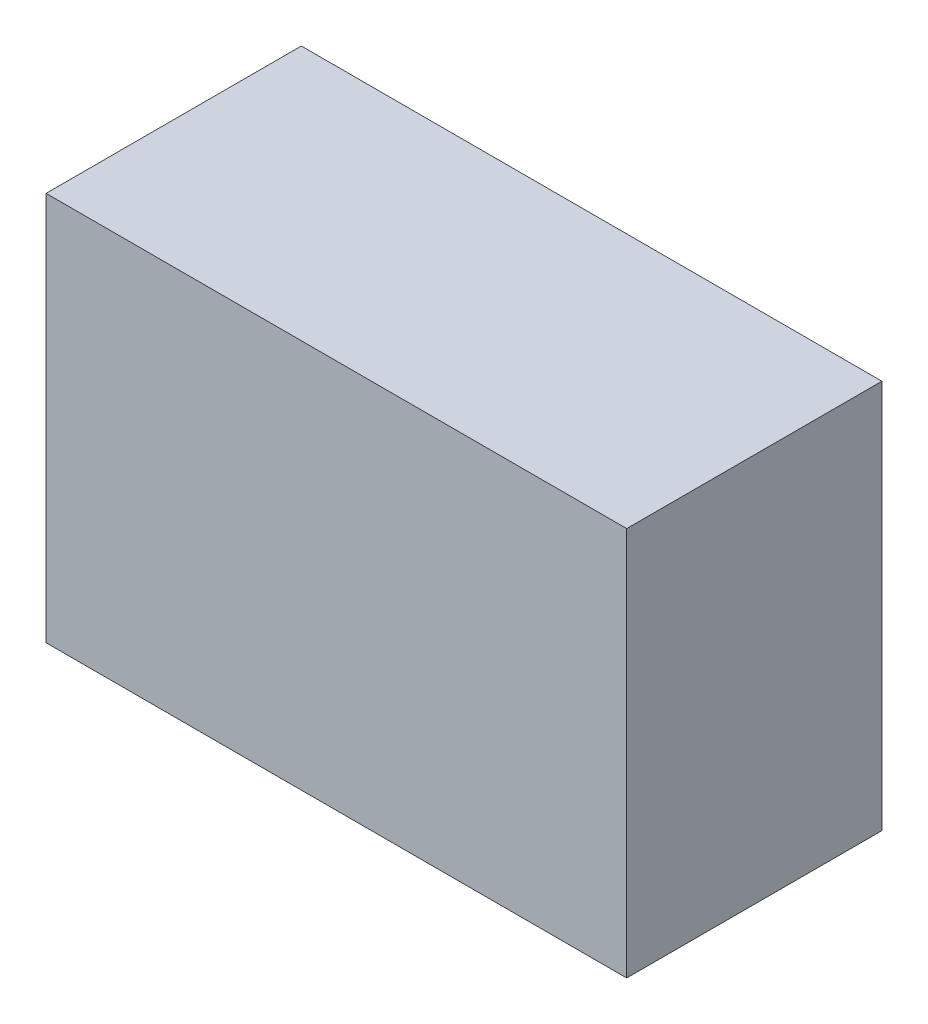
ISO-10303-21;
HEADER;
FILE_DESCRIPTION(('STEP AP214'),'2;1');
FILE_NAME('part.step','',(''),(''),'','','');
FILE_SCHEMA(('AUTOMOTIVE_DESIGN { 1 0 10303 214 1 1 1 1 }'));
ENDSEC;
DATA;
#1=APPLICATION_CONTEXT('core data for automotive mechanical design processes');
#2=APPLICATION_PROTOCOL_DEFINITION('international standard','automotive_design',2000,#1);
#3=PRODUCT_CONTEXT('',#1,'mechanical');
#4=PRODUCT('Part','Part','',(#3));
#5=PRODUCT_RELATED_PRODUCT_CATEGORY('part','',(#4));
#6=PRODUCT_DEFINITION_FORMATION('','',#4);
#7=PRODUCT_DEFINITION_CONTEXT('part definition',#1,'design');
#8=PRODUCT_DEFINITION('design','',#6,#7);
#9=PRODUCT_DEFINITION_SHAPE('','',#8);
#10=(LENGTH_UNIT() NAMED_UNIT(*) SI_UNIT(.MILLI.,.METRE.));
#11=(NAMED_UNIT(*) PLANE_ANGLE_UNIT() SI_UNIT($,.RADIAN.));
#12=(NAMED_UNIT(*) SI_UNIT($,.STERADIAN.) SOLID_ANGLE_UNIT());
#13=UNCERTAINTY_MEASURE_WITH_UNIT(LENGTH_MEASURE(1.E-05),#10,'distance_accuracy_value','');
#14=(GEOMETRIC_REPRESENTATION_CONTEXT(3) GLOBAL_UNCERTAINTY_ASSIGNED_CONTEXT((#13)) GLOBAL_UNIT_ASSIGNED_CONTEXT((#10,
#11,#12)) REPRESENTATION_CONTEXT('',''));
#15=CARTESIAN_POINT('',(0.,0.,0.));
#16=DIRECTION('',(0.,0.,1.));
#17=DIRECTION('',(1.,0.,0.));
#18=AXIS2_PLACEMENT_3D('',#15,#16,#17);
#19=CARTESIAN_POINT('',(-0.45499782,-0.30499812,0.3999992));
#20=DIRECTION('',(0.,0.,1.));
#21=DIRECTION('',(1.,0.,0.));
#22=AXIS2_PLACEMENT_3D('',#19,#20,#21);
#23=PLANE('',#22);
#24=DIRECTION('',(-1.,0.,0.));
#25=VECTOR('',#24,1.);
#26=CARTESIAN_POINT('',(0.45499782,-0.30499812,0.3999992));
#27=LINE('',#26,#25);
#28=CARTESIAN_POINT('',(0.45499782,-0.30499812,0.3999992));
#29=VERTEX_POINT('',#28);
#30=CARTESIAN_POINT('',(-0.45499782,-0.30499812,0.3999992));
#31=VERTEX_POINT('',#30);
#32=EDGE_CURVE('E21',#29,#31,#27,.T.);
#33=ORIENTED_EDGE('',*,*,#32,.F.);
#34=DIRECTION('',(0.,-1.,0.));
#35=VECTOR('',#34,1.);
#36=CARTESIAN_POINT('',(0.45499782,0.30499812,0.3999992));
#37=LINE('',#36,#35);
#38=CARTESIAN_POINT('',(0.45499782,0.30499812,0.3999992));
#39=VERTEX_POINT('',#38);
#40=EDGE_CURVE('E108',#39,#29,#37,.T.);
#41=ORIENTED_EDGE('',*,*,#40,.F.);
#42=DIRECTION('',(1.,0.,0.));
#43=VECTOR('',#42,1.);
#44=CARTESIAN_POINT('',(-0.45499782,0.30499812,0.3999992));
#45=LINE('',#44,#43);
#46=CARTESIAN_POINT('',(-0.45499782,0.30499812,0.3999992));
#47=VERTEX_POINT('',#46);
#48=EDGE_CURVE('E84',#47,#39,#45,.T.);
#49=ORIENTED_EDGE('',*,*,#48,.F.);
#50=DIRECTION('',(0.,1.,0.));
#51=VECTOR('',#50,1.);
#52=CARTESIAN_POINT('',(-0.45499782,-0.30499812,0.3999992));
#53=LINE('',#52,#51);
#54=EDGE_CURVE('E88',#31,#47,#53,.T.);
#55=ORIENTED_EDGE('',*,*,#54,.F.);
#56=EDGE_LOOP('',(#33,#41,#49,#55));
#57=FACE_BOUND('',#56,.T.);
#58=ADVANCED_FACE('F17',(#57),#23,.T.);
#59=CARTESIAN_POINT('',(-0.45499782,-0.30499812,0.));
#60=DIRECTION('',(0.,0.,1.));
#61=DIRECTION('',(1.,0.,0.));
#62=AXIS2_PLACEMENT_3D('',#59,#60,#61);
#63=PLANE('',#62);
#64=DIRECTION('',(0.,1.,0.));
#65=VECTOR('',#64,1.);
#66=CARTESIAN_POINT('',(-0.45499782,-0.30499812,0.));
#67=LINE('',#66,#65);
#68=CARTESIAN_POINT('',(-0.45499782,-0.30499812,0.));
#69=VERTEX_POINT('',#68);
#70=CARTESIAN_POINT('',(-0.45499782,0.30499812,0.));
#71=VERTEX_POINT('',#70);
#72=EDGE_CURVE('E72',#69,#71,#67,.T.);
#73=ORIENTED_EDGE('',*,*,#72,.T.);
#74=DIRECTION('',(1.,0.,0.));
#75=VECTOR('',#74,1.);
#76=CARTESIAN_POINT('',(-0.45499782,0.30499812,0.));
#77=LINE('',#76,#75);
#78=CARTESIAN_POINT('',(0.45499782,0.30499812,0.));
#79=VERTEX_POINT('',#78);
#80=EDGE_CURVE('E106',#71,#79,#77,.T.);
#81=ORIENTED_EDGE('',*,*,#80,.T.);
#82=DIRECTION('',(0.,-1.,0.));
#83=VECTOR('',#82,1.);
#84=CARTESIAN_POINT('',(0.45499782,0.30499812,0.));
#85=LINE('',#84,#83);
#86=CARTESIAN_POINT('',(0.45499782,-0.30499812,0.));
#87=VERTEX_POINT('',#86);
#88=EDGE_CURVE('E74',#79,#87,#85,.T.);
#89=ORIENTED_EDGE('',*,*,#88,.T.);
#90=DIRECTION('',(-1.,0.,0.));
#91=VECTOR('',#90,1.);
#92=CARTESIAN_POINT('',(0.45499782,-0.30499812,0.));
#93=LINE('',#92,#91);
#94=EDGE_CURVE('E11',#87,#69,#93,.T.);
#95=ORIENTED_EDGE('',*,*,#94,.T.);
#96=EDGE_LOOP('',(#73,#81,#89,#95));
#97=FACE_BOUND('',#96,.T.);
#98=ADVANCED_FACE('F19',(#97),#63,.F.);
#99=CARTESIAN_POINT('',(0.45499782,-0.30499812,0.));
#100=DIRECTION('',(0.,-1.,0.));
#101=DIRECTION('',(0.,0.,-1.));
#102=AXIS2_PLACEMENT_3D('',#99,#100,#101);
#103=PLANE('',#102);
#104=DIRECTION('',(0.,0.,1.));
#105=VECTOR('',#104,1.);
#106=CARTESIAN_POINT('',(0.45499782,-0.30499812,0.));
#107=LINE('',#106,#105);
#108=EDGE_CURVE('E96',#87,#29,#107,.T.);
#109=ORIENTED_EDGE('',*,*,#108,.T.);
#110=ORIENTED_EDGE('',*,*,#32,.T.);
#111=DIRECTION('',(0.,0.,1.));
#112=VECTOR('',#111,1.);
#113=CARTESIAN_POINT('',(-0.45499782,-0.30499812,0.));
#114=LINE('',#113,#112);
#115=EDGE_CURVE('E80',#69,#31,#114,.T.);
#116=ORIENTED_EDGE('',*,*,#115,.F.);
#117=ORIENTED_EDGE('',*,*,#94,.F.);
#118=EDGE_LOOP('',(#109,#110,#116,#117));
#119=FACE_BOUND('',#118,.T.);
#120=ADVANCED_FACE('F86',(#119),#103,.T.);
#121=CARTESIAN_POINT('',(0.45499782,0.30499812,0.));
#122=DIRECTION('',(1.,0.,0.));
#123=DIRECTION('',(0.,1.,0.));
#124=AXIS2_PLACEMENT_3D('',#121,#122,#123);
#125=PLANE('',#124);
#126=DIRECTION('',(0.,0.,1.));
#127=VECTOR('',#126,1.);
#128=CARTESIAN_POINT('',(0.45499782,0.30499812,0.));
#129=LINE('',#128,#127);
#130=EDGE_CURVE('E103',#79,#39,#129,.T.);
#131=ORIENTED_EDGE('',*,*,#130,.T.);
#132=ORIENTED_EDGE('',*,*,#40,.T.);
#133=ORIENTED_EDGE('',*,*,#108,.F.);
#134=ORIENTED_EDGE('',*,*,#88,.F.);
#135=EDGE_LOOP('',(#131,#132,#133,#134));
#136=FACE_BOUND('',#135,.T.);
#137=ADVANCED_FACE('F120',(#136),#125,.T.);
#138=CARTESIAN_POINT('',(-0.45499782,0.30499812,0.));
#139=DIRECTION('',(0.,1.,0.));
#140=DIRECTION('',(1.,0.,0.));
#141=AXIS2_PLACEMENT_3D('',#138,#139,#140);
#142=PLANE('',#141);
#143=DIRECTION('',(0.,0.,1.));
#144=VECTOR('',#143,1.);
#145=CARTESIAN_POINT('',(-0.45499782,0.30499812,0.));
#146=LINE('',#145,#144);
#147=EDGE_CURVE('E82',#71,#47,#146,.T.);
#148=ORIENTED_EDGE('',*,*,#147,.T.);
#149=ORIENTED_EDGE('',*,*,#48,.T.);
#150=ORIENTED_EDGE('',*,*,#130,.F.);
#151=ORIENTED_EDGE('',*,*,#80,.F.);
#152=EDGE_LOOP('',(#148,#149,#150,#151));
#153=FACE_BOUND('',#152,.T.);
#154=ADVANCED_FACE('F123',(#153),#142,.T.);
#155=CARTESIAN_POINT('',(-0.45499782,-0.30499812,0.));
#156=DIRECTION('',(-1.,0.,0.));
#157=DIRECTION('',(0.,0.,1.));
#158=AXIS2_PLACEMENT_3D('',#155,#156,#157);
#159=PLANE('',#158);
#160=ORIENTED_EDGE('',*,*,#115,.T.);
#161=ORIENTED_EDGE('',*,*,#54,.T.);
#162=ORIENTED_EDGE('',*,*,#147,.F.);
#163=ORIENTED_EDGE('',*,*,#72,.F.);
#164=EDGE_LOOP('',(#160,#161,#162,#163));
#165=FACE_BOUND('',#164,.T.);
#166=ADVANCED_FACE('F78',(#165),#159,.T.);
#167=CLOSED_SHELL('',(#58,#98,#120,#137,#154,#166));
#168=MANIFOLD_SOLID_BREP('B1',#167);
#169=ADVANCED_BREP_SHAPE_REPRESENTATION('',(#18,#168),#14);
#170=SHAPE_DEFINITION_REPRESENTATION(#9,#169);
ENDSEC;
END-ISO-10303-21;
